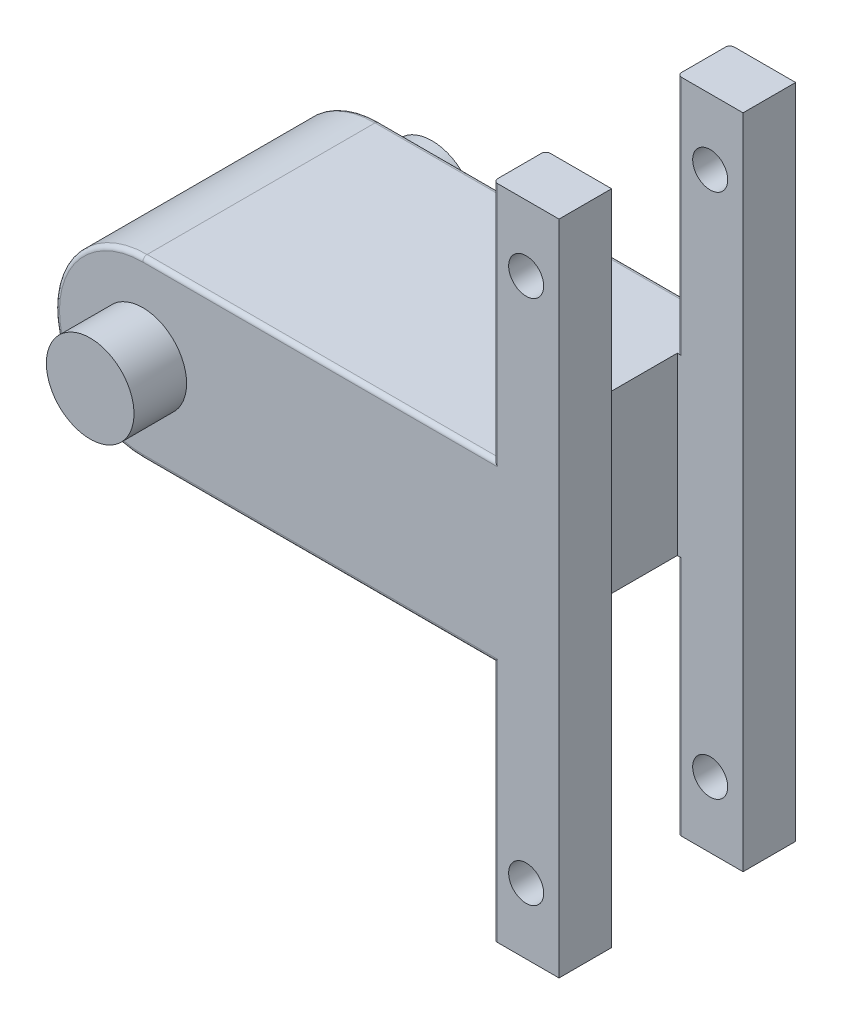
ISO-10303-21;
HEADER;
FILE_DESCRIPTION(('STEP AP214'),'2;1');
FILE_NAME('part.step','',(''),(''),'','','');
FILE_SCHEMA(('AUTOMOTIVE_DESIGN { 1 0 10303 214 1 1 1 1 }'));
ENDSEC;
DATA;
#1=APPLICATION_CONTEXT('core data for automotive mechanical design processes');
#2=APPLICATION_PROTOCOL_DEFINITION('international standard','automotive_design',2000,#1);
#3=PRODUCT_CONTEXT('',#1,'mechanical');
#4=PRODUCT('Part','Part','',(#3));
#5=PRODUCT_RELATED_PRODUCT_CATEGORY('part','',(#4));
#6=PRODUCT_DEFINITION_FORMATION('','',#4);
#7=PRODUCT_DEFINITION_CONTEXT('part definition',#1,'design');
#8=PRODUCT_DEFINITION('design','',#6,#7);
#9=PRODUCT_DEFINITION_SHAPE('','',#8);
#10=(LENGTH_UNIT() NAMED_UNIT(*) SI_UNIT(.MILLI.,.METRE.));
#11=(NAMED_UNIT(*) PLANE_ANGLE_UNIT() SI_UNIT($,.RADIAN.));
#12=(NAMED_UNIT(*) SI_UNIT($,.STERADIAN.) SOLID_ANGLE_UNIT());
#13=UNCERTAINTY_MEASURE_WITH_UNIT(LENGTH_MEASURE(1.E-05),#10,'distance_accuracy_value','');
#14=(GEOMETRIC_REPRESENTATION_CONTEXT(3) GLOBAL_UNCERTAINTY_ASSIGNED_CONTEXT((#13)) GLOBAL_UNIT_ASSIGNED_CONTEXT((#10,
#11,#12)) REPRESENTATION_CONTEXT('',''));
#15=CARTESIAN_POINT('',(0.,0.,0.));
#16=DIRECTION('',(0.,0.,1.));
#17=DIRECTION('',(1.,0.,0.));
#18=AXIS2_PLACEMENT_3D('',#15,#16,#17);
#19=CARTESIAN_POINT('',(0.,-20.,54.));
#20=DIRECTION('',(1.,0.,0.));
#21=DIRECTION('',(0.,1.,0.));
#22=AXIS2_PLACEMENT_3D('',#19,#20,#21);
#23=PLANE('',#22);
#24=DIRECTION('',(0.,0.,-1.));
#25=VECTOR('',#24,1.);
#26=CARTESIAN_POINT('',(0.,-20.,54.));
#27=LINE('',#26,#25);
#28=CARTESIAN_POINT('',(0.,-20.,11.));
#29=VERTEX_POINT('',#28);
#30=CARTESIAN_POINT('',(0.,-20.,1.));
#31=VERTEX_POINT('',#30);
#32=EDGE_CURVE('E269',#29,#31,#27,.T.);
#33=ORIENTED_EDGE('',*,*,#32,.T.);
#34=DIRECTION('',(0.,-1.,0.));
#35=VECTOR('',#34,1.);
#36=CARTESIAN_POINT('',(0.,-20.,1.));
#37=LINE('',#36,#35);
#38=CARTESIAN_POINT('',(0.,-75.,1.));
#39=VERTEX_POINT('',#38);
#40=EDGE_CURVE('E345',#31,#39,#37,.T.);
#41=ORIENTED_EDGE('',*,*,#40,.T.);
#42=DIRECTION('',(0.,0.,-1.));
#43=VECTOR('',#42,1.);
#44=CARTESIAN_POINT('',(0.,-75.,54.));
#45=LINE('',#44,#43);
#46=CARTESIAN_POINT('',(0.,-75.,11.));
#47=VERTEX_POINT('',#46);
#48=EDGE_CURVE('E255',#47,#39,#45,.T.);
#49=ORIENTED_EDGE('',*,*,#48,.F.);
#50=DIRECTION('',(0.,1.,0.));
#51=VECTOR('',#50,1.);
#52=CARTESIAN_POINT('',(0.,-20.,11.));
#53=LINE('',#52,#51);
#54=EDGE_CURVE('E341',#47,#29,#53,.T.);
#55=ORIENTED_EDGE('',*,*,#54,.T.);
#56=EDGE_LOOP('',(#33,#41,#49,#55));
#57=FACE_BOUND('',#56,.T.);
#58=ADVANCED_FACE('F45',(#57),#23,.F.);
#59=CARTESIAN_POINT('',(15.,-75.,54.));
#60=DIRECTION('',(0.,1.,0.));
#61=DIRECTION('',(0.,0.,1.));
#62=AXIS2_PLACEMENT_3D('',#59,#60,#61);
#63=PLANE('',#62);
#64=ORIENTED_EDGE('',*,*,#48,.T.);
#65=CARTESIAN_POINT('',(1.00000000000002,-75.,1.));
#66=DIRECTION('',(0.,1.,0.));
#67=DIRECTION('',(0.,0.,1.));
#68=AXIS2_PLACEMENT_3D('',#65,#66,#67);
#69=CIRCLE('',#68,1.);
#70=CARTESIAN_POINT('',(1.00000000000002,-75.,0.));
#71=VERTEX_POINT('',#70);
#72=EDGE_CURVE('E351',#39,#71,#69,.F.);
#73=ORIENTED_EDGE('',*,*,#72,.T.);
#74=DIRECTION('',(1.,0.,0.));
#75=VECTOR('',#74,1.);
#76=CARTESIAN_POINT('',(15.,-75.,0.));
#77=LINE('',#76,#75);
#78=CARTESIAN_POINT('',(15.,-75.,0.));
#79=VERTEX_POINT('',#78);
#80=EDGE_CURVE('E506',#71,#79,#77,.T.);
#81=ORIENTED_EDGE('',*,*,#80,.T.);
#82=DIRECTION('',(0.,0.,-1.));
#83=VECTOR('',#82,1.);
#84=CARTESIAN_POINT('',(15.,-75.,54.));
#85=LINE('',#84,#83);
#86=CARTESIAN_POINT('',(14.9999999999998,-75.,12.));
#87=VERTEX_POINT('',#86);
#88=EDGE_CURVE('E256',#87,#79,#85,.T.);
#89=ORIENTED_EDGE('',*,*,#88,.F.);
#90=DIRECTION('',(-1.,0.,0.));
#91=VECTOR('',#90,1.);
#92=CARTESIAN_POINT('',(14.9999999999998,-75.,12.));
#93=LINE('',#92,#91);
#94=CARTESIAN_POINT('',(1.00000000000002,-75.,12.));
#95=VERTEX_POINT('',#94);
#96=EDGE_CURVE('E236',#87,#95,#93,.T.);
#97=ORIENTED_EDGE('',*,*,#96,.T.);
#98=CARTESIAN_POINT('',(1.00000000000002,-75.,11.));
#99=DIRECTION('',(0.,1.,0.));
#100=DIRECTION('',(0.,0.,1.));
#101=AXIS2_PLACEMENT_3D('',#98,#99,#100);
#102=CIRCLE('',#101,1.);
#103=EDGE_CURVE('E348',#95,#47,#102,.F.);
#104=ORIENTED_EDGE('',*,*,#103,.T.);
#105=EDGE_LOOP('',(#64,#73,#81,#89,#97,#104));
#106=FACE_BOUND('',#105,.T.);
#107=ADVANCED_FACE('F565',(#106),#63,.F.);
#108=CARTESIAN_POINT('',(15.,75.,54.));
#109=DIRECTION('',(-1.,0.,0.));
#110=DIRECTION('',(0.,-1.,0.));
#111=AXIS2_PLACEMENT_3D('',#108,#109,#110);
#112=PLANE('',#111);
#113=DIRECTION('',(0.,0.,-1.));
#114=VECTOR('',#113,1.);
#115=CARTESIAN_POINT('',(15.,75.,54.));
#116=LINE('',#115,#114);
#117=CARTESIAN_POINT('',(15.0000000000001,75.,12.));
#118=VERTEX_POINT('',#117);
#119=CARTESIAN_POINT('',(15.,75.,0.));
#120=VERTEX_POINT('',#119);
#121=EDGE_CURVE('E481',#118,#120,#116,.T.);
#122=ORIENTED_EDGE('',*,*,#121,.F.);
#123=DIRECTION('',(0.,1.,0.));
#124=VECTOR('',#123,1.);
#125=CARTESIAN_POINT('',(14.9999999999998,-75.,12.));
#126=LINE('',#125,#124);
#127=EDGE_CURVE('E249',#87,#118,#126,.T.);
#128=ORIENTED_EDGE('',*,*,#127,.F.);
#129=ORIENTED_EDGE('',*,*,#88,.T.);
#130=DIRECTION('',(0.,1.,0.));
#131=VECTOR('',#130,1.);
#132=CARTESIAN_POINT('',(15.,75.,0.));
#133=LINE('',#132,#131);
#134=EDGE_CURVE('E502',#79,#120,#133,.T.);
#135=ORIENTED_EDGE('',*,*,#134,.T.);
#136=EDGE_LOOP('',(#122,#128,#129,#135));
#137=FACE_BOUND('',#136,.T.);
#138=ADVANCED_FACE('F598',(#137),#112,.F.);
#139=CARTESIAN_POINT('',(0.,75.,54.));
#140=DIRECTION('',(0.,-1.,0.));
#141=DIRECTION('',(1.,0.,0.));
#142=AXIS2_PLACEMENT_3D('',#139,#140,#141);
#143=PLANE('',#142);
#144=DIRECTION('',(0.,0.,-1.));
#145=VECTOR('',#144,1.);
#146=CARTESIAN_POINT('',(0.,75.,54.));
#147=LINE('',#146,#145);
#148=CARTESIAN_POINT('',(0.,75.,11.));
#149=VERTEX_POINT('',#148);
#150=CARTESIAN_POINT('',(0.,75.,1.));
#151=VERTEX_POINT('',#150);
#152=EDGE_CURVE('E482',#149,#151,#147,.T.);
#153=ORIENTED_EDGE('',*,*,#152,.F.);
#154=CARTESIAN_POINT('',(0.999999999999971,75.,11.));
#155=DIRECTION('',(0.,-1.,0.));
#156=DIRECTION('',(1.,0.,0.));
#157=AXIS2_PLACEMENT_3D('',#154,#155,#156);
#158=CIRCLE('',#157,1.);
#159=CARTESIAN_POINT('',(0.999999999999978,75.,12.));
#160=VERTEX_POINT('',#159);
#161=EDGE_CURVE('E410',#149,#160,#158,.F.);
#162=ORIENTED_EDGE('',*,*,#161,.T.);
#163=DIRECTION('',(-1.,0.,0.));
#164=VECTOR('',#163,1.);
#165=CARTESIAN_POINT('',(15.0000000000001,75.,12.));
#166=LINE('',#165,#164);
#167=EDGE_CURVE('E237',#118,#160,#166,.T.);
#168=ORIENTED_EDGE('',*,*,#167,.F.);
#169=ORIENTED_EDGE('',*,*,#121,.T.);
#170=DIRECTION('',(-1.,0.,0.));
#171=VECTOR('',#170,1.);
#172=CARTESIAN_POINT('',(0.,75.,0.));
#173=LINE('',#172,#171);
#174=CARTESIAN_POINT('',(0.999999999999971,75.,0.));
#175=VERTEX_POINT('',#174);
#176=EDGE_CURVE('E497',#120,#175,#173,.T.);
#177=ORIENTED_EDGE('',*,*,#176,.T.);
#178=CARTESIAN_POINT('',(0.999999999999971,75.,1.));
#179=DIRECTION('',(0.,-1.,0.));
#180=DIRECTION('',(1.,0.,0.));
#181=AXIS2_PLACEMENT_3D('',#178,#179,#180);
#182=CIRCLE('',#181,1.);
#183=EDGE_CURVE('E407',#175,#151,#182,.F.);
#184=ORIENTED_EDGE('',*,*,#183,.T.);
#185=EDGE_LOOP('',(#153,#162,#168,#169,#177,#184));
#186=FACE_BOUND('',#185,.T.);
#187=ADVANCED_FACE('F604',(#186),#143,.F.);
#188=CARTESIAN_POINT('',(0.,75.,54.));
#189=DIRECTION('',(1.,0.,0.));
#190=DIRECTION('',(0.,1.,0.));
#191=AXIS2_PLACEMENT_3D('',#188,#189,#190);
#192=PLANE('',#191);
#193=DIRECTION('',(0.,0.,-1.));
#194=VECTOR('',#193,1.);
#195=CARTESIAN_POINT('',(0.,20.,54.));
#196=LINE('',#195,#194);
#197=CARTESIAN_POINT('',(0.,20.,11.));
#198=VERTEX_POINT('',#197);
#199=CARTESIAN_POINT('',(0.,20.,1.));
#200=VERTEX_POINT('',#199);
#201=EDGE_CURVE('E487',#198,#200,#196,.T.);
#202=ORIENTED_EDGE('',*,*,#201,.F.);
#203=DIRECTION('',(0.,1.,0.));
#204=VECTOR('',#203,1.);
#205=CARTESIAN_POINT('',(0.,75.,11.));
#206=LINE('',#205,#204);
#207=EDGE_CURVE('E403',#198,#149,#206,.T.);
#208=ORIENTED_EDGE('',*,*,#207,.T.);
#209=ORIENTED_EDGE('',*,*,#152,.T.);
#210=DIRECTION('',(0.,-1.,0.));
#211=VECTOR('',#210,1.);
#212=CARTESIAN_POINT('',(0.,75.,1.));
#213=LINE('',#212,#211);
#214=EDGE_CURVE('E400',#151,#200,#213,.T.);
#215=ORIENTED_EDGE('',*,*,#214,.T.);
#216=EDGE_LOOP('',(#202,#208,#209,#215));
#217=FACE_BOUND('',#216,.T.);
#218=ADVANCED_FACE('F610',(#217),#192,.F.);
#219=CARTESIAN_POINT('',(7.49999999999998,60.,54.));
#220=DIRECTION('',(0.,0.,-1.));
#221=DIRECTION('',(-1.,0.,0.));
#222=AXIS2_PLACEMENT_3D('',#219,#220,#221);
#223=CYLINDRICAL_SURFACE('',#222,4.);
#224=CARTESIAN_POINT('',(7.49999999999998,60.,12.));
#225=DIRECTION('',(0.,0.,-1.));
#226=DIRECTION('',(-1.,0.,0.));
#227=AXIS2_PLACEMENT_3D('',#224,#225,#226);
#228=CIRCLE('',#227,4.);
#229=CARTESIAN_POINT('',(3.49999999999998,60.,12.));
#230=VERTEX_POINT('',#229);
#231=EDGE_CURVE('E297',#230,#230,#228,.T.);
#232=ORIENTED_EDGE('',*,*,#231,.F.);
#233=EDGE_LOOP('',(#232));
#234=FACE_BOUND('',#233,.T.);
#235=CARTESIAN_POINT('',(7.49999999999998,60.,0.));
#236=DIRECTION('',(0.,0.,1.));
#237=DIRECTION('',(1.,0.,0.));
#238=AXIS2_PLACEMENT_3D('',#235,#236,#237);
#239=CIRCLE('',#238,4.);
#240=CARTESIAN_POINT('',(11.5,60.,0.));
#241=VERTEX_POINT('',#240);
#242=EDGE_CURVE('E516',#241,#241,#239,.T.);
#243=ORIENTED_EDGE('',*,*,#242,.F.);
#244=EDGE_LOOP('',(#243));
#245=FACE_BOUND('',#244,.T.);
#246=ADVANCED_FACE('F845',(#234,#245),#223,.F.);
#247=CARTESIAN_POINT('',(7.50000000000001,-60.,54.));
#248=DIRECTION('',(0.,0.,-1.));
#249=DIRECTION('',(-1.,0.,0.));
#250=AXIS2_PLACEMENT_3D('',#247,#248,#249);
#251=CYLINDRICAL_SURFACE('',#250,4.);
#252=CARTESIAN_POINT('',(7.50000000000001,-60.,12.));
#253=DIRECTION('',(0.,0.,-1.));
#254=DIRECTION('',(-1.,0.,0.));
#255=AXIS2_PLACEMENT_3D('',#252,#253,#254);
#256=CIRCLE('',#255,4.);
#257=CARTESIAN_POINT('',(3.50000000000001,-60.,12.));
#258=VERTEX_POINT('',#257);
#259=EDGE_CURVE('E293',#258,#258,#256,.T.);
#260=ORIENTED_EDGE('',*,*,#259,.F.);
#261=EDGE_LOOP('',(#260));
#262=FACE_BOUND('',#261,.T.);
#263=CARTESIAN_POINT('',(7.50000000000001,-60.,0.));
#264=DIRECTION('',(0.,0.,1.));
#265=DIRECTION('',(1.,0.,0.));
#266=AXIS2_PLACEMENT_3D('',#263,#264,#265);
#267=CIRCLE('',#266,4.);
#268=CARTESIAN_POINT('',(11.5,-60.,0.));
#269=VERTEX_POINT('',#268);
#270=EDGE_CURVE('E524',#269,#269,#267,.T.);
#271=ORIENTED_EDGE('',*,*,#270,.F.);
#272=EDGE_LOOP('',(#271));
#273=FACE_BOUND('',#272,.T.);
#274=ADVANCED_FACE('F853',(#262,#273),#251,.F.);
#275=CARTESIAN_POINT('',(-80.,0.,54.));
#276=DIRECTION('',(0.,0.,1.));
#277=DIRECTION('',(1.,0.,0.));
#278=AXIS2_PLACEMENT_3D('',#275,#276,#277);
#279=PLANE('',#278);
#280=CARTESIAN_POINT('',(-80.,0.,54.));
#281=DIRECTION('',(0.,0.,1.));
#282=DIRECTION('',(1.,0.,0.));
#283=AXIS2_PLACEMENT_3D('',#280,#281,#282);
#284=CIRCLE('',#283,9.99999999999999);
#285=CARTESIAN_POINT('',(-70.,0.,54.));
#286=VERTEX_POINT('',#285);
#287=EDGE_CURVE('E282',#286,#286,#284,.T.);
#288=ORIENTED_EDGE('',*,*,#287,.F.);
#289=EDGE_LOOP('',(#288));
#290=FACE_BOUND('',#289,.T.);
#291=CARTESIAN_POINT('',(7.49999999999998,60.,54.));
#292=DIRECTION('',(0.,0.,1.));
#293=DIRECTION('',(1.,0.,0.));
#294=AXIS2_PLACEMENT_3D('',#291,#292,#293);
#295=CIRCLE('',#294,4.);
#296=CARTESIAN_POINT('',(11.5,60.,54.));
#297=VERTEX_POINT('',#296);
#298=EDGE_CURVE('E509',#297,#297,#295,.T.);
#299=ORIENTED_EDGE('',*,*,#298,.F.);
#300=EDGE_LOOP('',(#299));
#301=FACE_BOUND('',#300,.T.);
#302=DIRECTION('',(1.,0.,0.));
#303=VECTOR('',#302,1.);
#304=CARTESIAN_POINT('',(0.,-19.,54.));
#305=LINE('',#304,#303);
#306=CARTESIAN_POINT('',(-80.,-19.,54.));
#307=VERTEX_POINT('',#306);
#308=CARTESIAN_POINT('',(1.00000000000001,-19.,54.));
#309=VERTEX_POINT('',#308);
#310=EDGE_CURVE('E334',#307,#309,#305,.T.);
#311=ORIENTED_EDGE('',*,*,#310,.T.);
#312=DIRECTION('',(0.,-1.,0.));
#313=VECTOR('',#312,1.);
#314=CARTESIAN_POINT('',(1.00000000000002,-75.,54.));
#315=LINE('',#314,#313);
#316=CARTESIAN_POINT('',(1.00000000000002,-75.,54.));
#317=VERTEX_POINT('',#316);
#318=EDGE_CURVE('E338',#309,#317,#315,.T.);
#319=ORIENTED_EDGE('',*,*,#318,.T.);
#320=DIRECTION('',(1.,0.,0.));
#321=VECTOR('',#320,1.);
#322=CARTESIAN_POINT('',(15.,-75.,54.));
#323=LINE('',#322,#321);
#324=CARTESIAN_POINT('',(15.,-75.,54.));
#325=VERTEX_POINT('',#324);
#326=EDGE_CURVE('E501',#317,#325,#323,.T.);
#327=ORIENTED_EDGE('',*,*,#326,.T.);
#328=DIRECTION('',(0.,1.,0.));
#329=VECTOR('',#328,1.);
#330=CARTESIAN_POINT('',(15.,75.,54.));
#331=LINE('',#330,#329);
#332=CARTESIAN_POINT('',(15.,75.,54.));
#333=VERTEX_POINT('',#332);
#334=EDGE_CURVE('E253',#325,#333,#331,.T.);
#335=ORIENTED_EDGE('',*,*,#334,.T.);
#336=DIRECTION('',(-1.,0.,0.));
#337=VECTOR('',#336,1.);
#338=CARTESIAN_POINT('',(0.,75.,54.));
#339=LINE('',#338,#337);
#340=CARTESIAN_POINT('',(0.999999999999979,75.,54.));
#341=VERTEX_POINT('',#340);
#342=EDGE_CURVE('E496',#333,#341,#339,.T.);
#343=ORIENTED_EDGE('',*,*,#342,.T.);
#344=DIRECTION('',(0.,-1.,0.));
#345=VECTOR('',#344,1.);
#346=CARTESIAN_POINT('',(0.999999999999995,20.,54.));
#347=LINE('',#346,#345);
#348=CARTESIAN_POINT('',(0.999999999999995,19.,54.));
#349=VERTEX_POINT('',#348);
#350=EDGE_CURVE('E328',#341,#349,#347,.T.);
#351=ORIENTED_EDGE('',*,*,#350,.T.);
#352=DIRECTION('',(-1.,0.,0.));
#353=VECTOR('',#352,1.);
#354=CARTESIAN_POINT('',(-80.,19.,54.));
#355=LINE('',#354,#353);
#356=CARTESIAN_POINT('',(-80.,19.,54.));
#357=VERTEX_POINT('',#356);
#358=EDGE_CURVE('E325',#349,#357,#355,.T.);
#359=ORIENTED_EDGE('',*,*,#358,.T.);
#360=CARTESIAN_POINT('',(-80.,0.,54.));
#361=DIRECTION('',(0.,0.,1.));
#362=DIRECTION('',(1.,0.,0.));
#363=AXIS2_PLACEMENT_3D('',#360,#361,#362);
#364=CIRCLE('',#363,19.);
#365=EDGE_CURVE('E331',#357,#307,#364,.T.);
#366=ORIENTED_EDGE('',*,*,#365,.T.);
#367=EDGE_LOOP('',(#311,#319,#327,#335,#343,#351,#359,#366));
#368=FACE_BOUND('',#367,.T.);
#369=CARTESIAN_POINT('',(7.50000000000001,-60.,54.));
#370=DIRECTION('',(0.,0.,1.));
#371=DIRECTION('',(1.,0.,0.));
#372=AXIS2_PLACEMENT_3D('',#369,#370,#371);
#373=CIRCLE('',#372,4.);
#374=CARTESIAN_POINT('',(11.5,-60.,54.));
#375=VERTEX_POINT('',#374);
#376=EDGE_CURVE('E520',#375,#375,#373,.T.);
#377=ORIENTED_EDGE('',*,*,#376,.F.);
#378=EDGE_LOOP('',(#377));
#379=FACE_BOUND('',#378,.T.);
#380=ADVANCED_FACE('F637',(#290,#301,#368,#379),#279,.T.);
#381=CARTESIAN_POINT('',(-80.,0.,0.));
#382=DIRECTION('',(0.,0.,1.));
#383=DIRECTION('',(1.,0.,0.));
#384=AXIS2_PLACEMENT_3D('',#381,#382,#383);
#385=PLANE('',#384);
#386=ORIENTED_EDGE('',*,*,#80,.F.);
#387=DIRECTION('',(0.,-1.,0.));
#388=VECTOR('',#387,1.);
#389=CARTESIAN_POINT('',(1.,0.,0.));
#390=LINE('',#389,#388);
#391=CARTESIAN_POINT('',(1.,-19.,0.));
#392=VERTEX_POINT('',#391);
#393=EDGE_CURVE('E316',#71,#392,#390,.F.);
#394=ORIENTED_EDGE('',*,*,#393,.T.);
#395=DIRECTION('',(1.,0.,0.));
#396=VECTOR('',#395,1.);
#397=CARTESIAN_POINT('',(-80.,-19.,0.));
#398=LINE('',#397,#396);
#399=CARTESIAN_POINT('',(-80.,-19.,0.));
#400=VERTEX_POINT('',#399);
#401=EDGE_CURVE('E313',#392,#400,#398,.F.);
#402=ORIENTED_EDGE('',*,*,#401,.T.);
#403=CARTESIAN_POINT('',(-80.,0.,0.));
#404=DIRECTION('',(0.,0.,1.));
#405=DIRECTION('',(1.,0.,0.));
#406=AXIS2_PLACEMENT_3D('',#403,#404,#405);
#407=CIRCLE('',#406,19.);
#408=CARTESIAN_POINT('',(-80.,19.,0.));
#409=VERTEX_POINT('',#408);
#410=EDGE_CURVE('E310',#400,#409,#407,.F.);
#411=ORIENTED_EDGE('',*,*,#410,.T.);
#412=DIRECTION('',(-1.,0.,0.));
#413=VECTOR('',#412,1.);
#414=CARTESIAN_POINT('',(-80.,19.,0.));
#415=LINE('',#414,#413);
#416=CARTESIAN_POINT('',(0.999999999999987,19.,0.));
#417=VERTEX_POINT('',#416);
#418=EDGE_CURVE('E304',#409,#417,#415,.F.);
#419=ORIENTED_EDGE('',*,*,#418,.T.);
#420=DIRECTION('',(0.,-1.,0.));
#421=VECTOR('',#420,1.);
#422=CARTESIAN_POINT('',(1.,0.,0.));
#423=LINE('',#422,#421);
#424=EDGE_CURVE('E307',#417,#175,#423,.F.);
#425=ORIENTED_EDGE('',*,*,#424,.T.);
#426=ORIENTED_EDGE('',*,*,#176,.F.);
#427=ORIENTED_EDGE('',*,*,#134,.F.);
#428=EDGE_LOOP('',(#386,#394,#402,#411,#419,#425,#426,#427));
#429=FACE_BOUND('',#428,.T.);
#430=CARTESIAN_POINT('',(-80.,0.,0.));
#431=DIRECTION('',(0.,0.,1.));
#432=DIRECTION('',(1.,0.,0.));
#433=AXIS2_PLACEMENT_3D('',#430,#431,#432);
#434=CIRCLE('',#433,9.99999999999999);
#435=CARTESIAN_POINT('',(-70.,0.,0.));
#436=VERTEX_POINT('',#435);
#437=EDGE_CURVE('E278',#436,#436,#434,.F.);
#438=ORIENTED_EDGE('',*,*,#437,.F.);
#439=EDGE_LOOP('',(#438));
#440=FACE_BOUND('',#439,.T.);
#441=ORIENTED_EDGE('',*,*,#242,.T.);
#442=EDGE_LOOP('',(#441));
#443=FACE_BOUND('',#442,.T.);
#444=ORIENTED_EDGE('',*,*,#270,.T.);
#445=EDGE_LOOP('',(#444));
#446=FACE_BOUND('',#445,.T.);
#447=ADVANCED_FACE('F593',(#429,#440,#443,#446),#385,.F.);
#448=CARTESIAN_POINT('',(-80.,0.,54.));
#449=DIRECTION('',(0.,0.,-1.));
#450=DIRECTION('',(-1.,0.,0.));
#451=AXIS2_PLACEMENT_3D('',#448,#449,#450);
#452=CYLINDRICAL_SURFACE('',#451,20.);
#453=DIRECTION('',(0.,0.,-1.));
#454=VECTOR('',#453,1.);
#455=CARTESIAN_POINT('',(-80.,20.,54.));
#456=LINE('',#455,#454);
#457=CARTESIAN_POINT('',(-80.,20.,53.));
#458=VERTEX_POINT('',#457);
#459=CARTESIAN_POINT('',(-80.,20.,1.));
#460=VERTEX_POINT('',#459);
#461=EDGE_CURVE('E492',#458,#460,#456,.T.);
#462=ORIENTED_EDGE('',*,*,#461,.T.);
#463=CARTESIAN_POINT('',(-80.,0.,1.));
#464=DIRECTION('',(0.,0.,1.));
#465=DIRECTION('',(1.,0.,0.));
#466=AXIS2_PLACEMENT_3D('',#463,#464,#465);
#467=CIRCLE('',#466,20.);
#468=CARTESIAN_POINT('',(-80.,-20.,1.));
#469=VERTEX_POINT('',#468);
#470=EDGE_CURVE('E322',#460,#469,#467,.T.);
#471=ORIENTED_EDGE('',*,*,#470,.T.);
#472=DIRECTION('',(0.,0.,-1.));
#473=VECTOR('',#472,1.);
#474=CARTESIAN_POINT('',(-80.,-20.,54.));
#475=LINE('',#474,#473);
#476=CARTESIAN_POINT('',(-80.,-20.,53.));
#477=VERTEX_POINT('',#476);
#478=EDGE_CURVE('E274',#477,#469,#475,.T.);
#479=ORIENTED_EDGE('',*,*,#478,.F.);
#480=CARTESIAN_POINT('',(-80.,0.,53.));
#481=DIRECTION('',(0.,0.,1.));
#482=DIRECTION('',(1.,0.,0.));
#483=AXIS2_PLACEMENT_3D('',#480,#481,#482);
#484=CIRCLE('',#483,20.);
#485=EDGE_CURVE('E319',#477,#458,#484,.F.);
#486=ORIENTED_EDGE('',*,*,#485,.T.);
#487=EDGE_LOOP('',(#462,#471,#479,#486));
#488=FACE_BOUND('',#487,.T.);
#489=ADVANCED_FACE('F629',(#488),#452,.T.);
#490=CARTESIAN_POINT('',(-80.,-20.,54.));
#491=DIRECTION('',(0.,1.,0.));
#492=DIRECTION('',(-1.,0.,0.));
#493=AXIS2_PLACEMENT_3D('',#490,#491,#492);
#494=PLANE('',#493);
#495=ORIENTED_EDGE('',*,*,#478,.T.);
#496=DIRECTION('',(1.,0.,0.));
#497=VECTOR('',#496,1.);
#498=CARTESIAN_POINT('',(-80.,-20.,1.));
#499=LINE('',#498,#497);
#500=EDGE_CURVE('E300',#469,#31,#499,.T.);
#501=ORIENTED_EDGE('',*,*,#500,.T.);
#502=ORIENTED_EDGE('',*,*,#32,.F.);
#503=CARTESIAN_POINT('',(1.,-20.,11.));
#504=DIRECTION('',(0.,1.,0.));
#505=DIRECTION('',(-1.,0.,0.));
#506=AXIS2_PLACEMENT_3D('',#503,#504,#505);
#507=CIRCLE('',#506,1.);
#508=CARTESIAN_POINT('',(1.,-20.,12.));
#509=VERTEX_POINT('',#508);
#510=EDGE_CURVE('E419',#29,#509,#507,.T.);
#511=ORIENTED_EDGE('',*,*,#510,.T.);
#512=DIRECTION('',(1.,0.,0.));
#513=VECTOR('',#512,1.);
#514=CARTESIAN_POINT('',(14.9999999999998,-20.,12.));
#515=LINE('',#514,#513);
#516=CARTESIAN_POINT('',(-2.05176835411853E-13,-20.,12.));
#517=VERTEX_POINT('',#516);
#518=EDGE_CURVE('E71',#517,#509,#515,.T.);
#519=ORIENTED_EDGE('',*,*,#518,.F.);
#520=DIRECTION('',(0.,0.,1.));
#521=VECTOR('',#520,1.);
#522=CARTESIAN_POINT('',(-2.08166817117217E-13,-20.,54.));
#523=LINE('',#522,#521);
#524=CARTESIAN_POINT('',(-2.05176835411853E-13,-20.,42.));
#525=VERTEX_POINT('',#524);
#526=EDGE_CURVE('E539',#517,#525,#523,.T.);
#527=ORIENTED_EDGE('',*,*,#526,.T.);
#528=DIRECTION('',(-1.,0.,0.));
#529=VECTOR('',#528,1.);
#530=CARTESIAN_POINT('',(14.9999999999998,-20.,42.));
#531=LINE('',#530,#529);
#532=CARTESIAN_POINT('',(0.999999999999999,-20.,42.));
#533=VERTEX_POINT('',#532);
#534=EDGE_CURVE('E371',#533,#525,#531,.T.);
#535=ORIENTED_EDGE('',*,*,#534,.F.);
#536=CARTESIAN_POINT('',(1.,-20.,43.));
#537=DIRECTION('',(0.,1.,0.));
#538=DIRECTION('',(-1.,0.,0.));
#539=AXIS2_PLACEMENT_3D('',#536,#537,#538);
#540=CIRCLE('',#539,1.);
#541=CARTESIAN_POINT('',(0.,-20.,43.));
#542=VERTEX_POINT('',#541);
#543=EDGE_CURVE('E422',#533,#542,#540,.T.);
#544=ORIENTED_EDGE('',*,*,#543,.T.);
#545=CARTESIAN_POINT('',(0.,-20.,53.));
#546=VERTEX_POINT('',#545);
#547=EDGE_CURVE('E270',#546,#542,#27,.T.);
#548=ORIENTED_EDGE('',*,*,#547,.F.);
#549=DIRECTION('',(1.,0.,0.));
#550=VECTOR('',#549,1.);
#551=CARTESIAN_POINT('',(-80.,-20.,53.));
#552=LINE('',#551,#550);
#553=EDGE_CURVE('E286',#546,#477,#552,.F.);
#554=ORIENTED_EDGE('',*,*,#553,.T.);
#555=EDGE_LOOP('',(#495,#501,#502,#511,#519,#527,#535,#544,#548,#554));
#556=FACE_BOUND('',#555,.T.);
#557=ADVANCED_FACE('F576',(#556),#494,.F.);
#558=ORIENTED_EDGE('',*,*,#547,.T.);
#559=DIRECTION('',(0.,1.,0.));
#560=VECTOR('',#559,1.);
#561=CARTESIAN_POINT('',(0.,-20.,43.));
#562=LINE('',#561,#560);
#563=CARTESIAN_POINT('',(0.,-75.,43.));
#564=VERTEX_POINT('',#563);
#565=EDGE_CURVE('E380',#542,#564,#562,.F.);
#566=ORIENTED_EDGE('',*,*,#565,.T.);
#567=CARTESIAN_POINT('',(0.,-75.,53.));
#568=VERTEX_POINT('',#567);
#569=EDGE_CURVE('E261',#568,#564,#45,.T.);
#570=ORIENTED_EDGE('',*,*,#569,.F.);
#571=DIRECTION('',(0.,-1.,0.));
#572=VECTOR('',#571,1.);
#573=CARTESIAN_POINT('',(0.,-20.,53.));
#574=LINE('',#573,#572);
#575=EDGE_CURVE('E377',#568,#546,#574,.F.);
#576=ORIENTED_EDGE('',*,*,#575,.T.);
#577=EDGE_LOOP('',(#558,#566,#570,#576));
#578=FACE_BOUND('',#577,.T.);
#579=ADVANCED_FACE('F648',(#578),#23,.F.);
#580=ORIENTED_EDGE('',*,*,#569,.T.);
#581=CARTESIAN_POINT('',(1.00000000000002,-75.,43.));
#582=DIRECTION('',(0.,1.,0.));
#583=DIRECTION('',(0.,0.,1.));
#584=AXIS2_PLACEMENT_3D('',#581,#582,#583);
#585=CIRCLE('',#584,1.);
#586=CARTESIAN_POINT('',(1.00000000000001,-75.,42.));
#587=VERTEX_POINT('',#586);
#588=EDGE_CURVE('E231',#564,#587,#585,.F.);
#589=ORIENTED_EDGE('',*,*,#588,.T.);
#590=DIRECTION('',(1.,0.,0.));
#591=VECTOR('',#590,1.);
#592=CARTESIAN_POINT('',(14.9999999999998,-75.,42.));
#593=LINE('',#592,#591);
#594=CARTESIAN_POINT('',(14.9999999999998,-75.,42.));
#595=VERTEX_POINT('',#594);
#596=EDGE_CURVE('E222',#587,#595,#593,.T.);
#597=ORIENTED_EDGE('',*,*,#596,.T.);
#598=EDGE_CURVE('E228',#325,#595,#85,.T.);
#599=ORIENTED_EDGE('',*,*,#598,.F.);
#600=ORIENTED_EDGE('',*,*,#326,.F.);
#601=CARTESIAN_POINT('',(1.00000000000002,-75.,53.));
#602=DIRECTION('',(0.,1.,0.));
#603=DIRECTION('',(0.,0.,1.));
#604=AXIS2_PLACEMENT_3D('',#601,#602,#603);
#605=CIRCLE('',#604,1.);
#606=EDGE_CURVE('E383',#317,#568,#605,.F.);
#607=ORIENTED_EDGE('',*,*,#606,.T.);
#608=EDGE_LOOP('',(#580,#589,#597,#599,#600,#607));
#609=FACE_BOUND('',#608,.T.);
#610=ADVANCED_FACE('F225',(#609),#63,.F.);
#611=ORIENTED_EDGE('',*,*,#598,.T.);
#612=DIRECTION('',(0.,1.,0.));
#613=VECTOR('',#612,1.);
#614=CARTESIAN_POINT('',(14.9999999999998,-75.,42.));
#615=LINE('',#614,#613);
#616=CARTESIAN_POINT('',(15.0000000000001,75.,42.));
#617=VERTEX_POINT('',#616);
#618=EDGE_CURVE('E240',#595,#617,#615,.T.);
#619=ORIENTED_EDGE('',*,*,#618,.T.);
#620=EDGE_CURVE('E264',#333,#617,#116,.T.);
#621=ORIENTED_EDGE('',*,*,#620,.F.);
#622=ORIENTED_EDGE('',*,*,#334,.F.);
#623=EDGE_LOOP('',(#611,#619,#621,#622));
#624=FACE_BOUND('',#623,.T.);
#625=ADVANCED_FACE('F252',(#624),#112,.F.);
#626=CARTESIAN_POINT('',(0.,75.,53.));
#627=VERTEX_POINT('',#626);
#628=CARTESIAN_POINT('',(0.,75.,43.));
#629=VERTEX_POINT('',#628);
#630=EDGE_CURVE('E472',#627,#629,#147,.T.);
#631=ORIENTED_EDGE('',*,*,#630,.F.);
#632=CARTESIAN_POINT('',(0.999999999999979,75.,53.));
#633=DIRECTION('',(0.,-1.,0.));
#634=DIRECTION('',(1.,0.,0.));
#635=AXIS2_PLACEMENT_3D('',#632,#633,#634);
#636=CIRCLE('',#635,1.);
#637=EDGE_CURVE('E397',#627,#341,#636,.F.);
#638=ORIENTED_EDGE('',*,*,#637,.T.);
#639=ORIENTED_EDGE('',*,*,#342,.F.);
#640=ORIENTED_EDGE('',*,*,#620,.T.);
#641=DIRECTION('',(1.,0.,0.));
#642=VECTOR('',#641,1.);
#643=CARTESIAN_POINT('',(15.0000000000001,75.,42.));
#644=LINE('',#643,#642);
#645=CARTESIAN_POINT('',(0.99999999999997,75.,42.));
#646=VERTEX_POINT('',#645);
#647=EDGE_CURVE('E244',#646,#617,#644,.T.);
#648=ORIENTED_EDGE('',*,*,#647,.F.);
#649=CARTESIAN_POINT('',(0.999999999999971,75.,43.));
#650=DIRECTION('',(0.,-1.,0.));
#651=DIRECTION('',(1.,0.,0.));
#652=AXIS2_PLACEMENT_3D('',#649,#650,#651);
#653=CIRCLE('',#652,1.);
#654=EDGE_CURVE('E394',#646,#629,#653,.F.);
#655=ORIENTED_EDGE('',*,*,#654,.T.);
#656=EDGE_LOOP('',(#631,#638,#639,#640,#648,#655));
#657=FACE_BOUND('',#656,.T.);
#658=ADVANCED_FACE('F477',(#657),#143,.F.);
#659=CARTESIAN_POINT('',(0.,20.,53.));
#660=VERTEX_POINT('',#659);
#661=CARTESIAN_POINT('',(0.,20.,43.));
#662=VERTEX_POINT('',#661);
#663=EDGE_CURVE('E475',#660,#662,#196,.T.);
#664=ORIENTED_EDGE('',*,*,#663,.F.);
#665=DIRECTION('',(0.,-1.,0.));
#666=VECTOR('',#665,1.);
#667=CARTESIAN_POINT('',(0.,75.,53.));
#668=LINE('',#667,#666);
#669=EDGE_CURVE('E391',#660,#627,#668,.F.);
#670=ORIENTED_EDGE('',*,*,#669,.T.);
#671=ORIENTED_EDGE('',*,*,#630,.T.);
#672=DIRECTION('',(0.,1.,0.));
#673=VECTOR('',#672,1.);
#674=CARTESIAN_POINT('',(0.,75.,43.));
#675=LINE('',#674,#673);
#676=EDGE_CURVE('E388',#629,#662,#675,.F.);
#677=ORIENTED_EDGE('',*,*,#676,.T.);
#678=EDGE_LOOP('',(#664,#670,#671,#677));
#679=FACE_BOUND('',#678,.T.);
#680=ADVANCED_FACE('F471',(#679),#192,.F.);
#681=CARTESIAN_POINT('',(-80.,20.,54.));
#682=DIRECTION('',(0.,-1.,0.));
#683=DIRECTION('',(1.,0.,0.));
#684=AXIS2_PLACEMENT_3D('',#681,#682,#683);
#685=PLANE('',#684);
#686=ORIENTED_EDGE('',*,*,#201,.T.);
#687=DIRECTION('',(-1.,0.,0.));
#688=VECTOR('',#687,1.);
#689=CARTESIAN_POINT('',(-80.,20.,1.));
#690=LINE('',#689,#688);
#691=EDGE_CURVE('E416',#200,#460,#690,.T.);
#692=ORIENTED_EDGE('',*,*,#691,.T.);
#693=ORIENTED_EDGE('',*,*,#461,.F.);
#694=DIRECTION('',(-1.,0.,0.));
#695=VECTOR('',#694,1.);
#696=CARTESIAN_POINT('',(0.,20.,53.));
#697=LINE('',#696,#695);
#698=EDGE_CURVE('E413',#458,#660,#697,.F.);
#699=ORIENTED_EDGE('',*,*,#698,.T.);
#700=ORIENTED_EDGE('',*,*,#663,.T.);
#701=CARTESIAN_POINT('',(0.999999999999987,20.,43.));
#702=DIRECTION('',(0.,-1.,0.));
#703=DIRECTION('',(1.,0.,0.));
#704=AXIS2_PLACEMENT_3D('',#701,#702,#703);
#705=CIRCLE('',#704,1.);
#706=CARTESIAN_POINT('',(0.999999999999986,20.,42.));
#707=VERTEX_POINT('',#706);
#708=EDGE_CURVE('E55',#662,#707,#705,.T.);
#709=ORIENTED_EDGE('',*,*,#708,.T.);
#710=DIRECTION('',(1.,0.,0.));
#711=VECTOR('',#710,1.);
#712=CARTESIAN_POINT('',(14.9999999999998,20.,42.));
#713=LINE('',#712,#711);
#714=CARTESIAN_POINT('',(-1.31161967103509E-13,20.,42.));
#715=VERTEX_POINT('',#714);
#716=EDGE_CURVE('E63',#715,#707,#713,.T.);
#717=ORIENTED_EDGE('',*,*,#716,.F.);
#718=CARTESIAN_POINT('',(0.,20.,12.));
#719=VERTEX_POINT('',#718);
#720=EDGE_CURVE('E491',#715,#719,#196,.T.);
#721=ORIENTED_EDGE('',*,*,#720,.T.);
#722=DIRECTION('',(-1.,0.,0.));
#723=VECTOR('',#722,1.);
#724=CARTESIAN_POINT('',(14.9999999999998,20.,12.));
#725=LINE('',#724,#723);
#726=CARTESIAN_POINT('',(0.999999999999987,20.,12.));
#727=VERTEX_POINT('',#726);
#728=EDGE_CURVE('E354',#727,#719,#725,.T.);
#729=ORIENTED_EDGE('',*,*,#728,.F.);
#730=CARTESIAN_POINT('',(0.999999999999987,20.,11.));
#731=DIRECTION('',(0.,-1.,0.));
#732=DIRECTION('',(1.,0.,0.));
#733=AXIS2_PLACEMENT_3D('',#730,#731,#732);
#734=CIRCLE('',#733,1.);
#735=EDGE_CURVE('E11',#727,#198,#734,.T.);
#736=ORIENTED_EDGE('',*,*,#735,.T.);
#737=EDGE_LOOP('',(#686,#692,#693,#699,#700,#709,#717,#721,#729,#736));
#738=FACE_BOUND('',#737,.T.);
#739=ADVANCED_FACE('F613',(#738),#685,.F.);
#740=CARTESIAN_POINT('',(7.49999999999998,60.,42.));
#741=DIRECTION('',(0.,0.,1.));
#742=DIRECTION('',(1.,0.,0.));
#743=AXIS2_PLACEMENT_3D('',#740,#741,#742);
#744=CIRCLE('',#743,4.);
#745=CARTESIAN_POINT('',(11.5,60.,42.));
#746=VERTEX_POINT('',#745);
#747=EDGE_CURVE('E291',#746,#746,#744,.T.);
#748=ORIENTED_EDGE('',*,*,#747,.F.);
#749=EDGE_LOOP('',(#748));
#750=FACE_BOUND('',#749,.T.);
#751=ORIENTED_EDGE('',*,*,#298,.T.);
#752=EDGE_LOOP('',(#751));
#753=FACE_BOUND('',#752,.T.);
#754=ADVANCED_FACE('F856',(#750,#753),#223,.F.);
#755=CARTESIAN_POINT('',(7.50000000000001,-60.,42.));
#756=DIRECTION('',(0.,0.,1.));
#757=DIRECTION('',(1.,0.,0.));
#758=AXIS2_PLACEMENT_3D('',#755,#756,#757);
#759=CIRCLE('',#758,4.);
#760=CARTESIAN_POINT('',(11.5,-60.,42.));
#761=VERTEX_POINT('',#760);
#762=EDGE_CURVE('E287',#761,#761,#759,.T.);
#763=ORIENTED_EDGE('',*,*,#762,.F.);
#764=EDGE_LOOP('',(#763));
#765=FACE_BOUND('',#764,.T.);
#766=ORIENTED_EDGE('',*,*,#376,.T.);
#767=EDGE_LOOP('',(#766));
#768=FACE_BOUND('',#767,.T.);
#769=ADVANCED_FACE('F865',(#765,#768),#251,.F.);
#770=CARTESIAN_POINT('',(-80.,0.,-12.));
#771=DIRECTION('',(0.,0.,1.));
#772=DIRECTION('',(1.,0.,0.));
#773=AXIS2_PLACEMENT_3D('',#770,#771,#772);
#774=CYLINDRICAL_SURFACE('',#773,9.99999999999999);
#775=CARTESIAN_POINT('',(-80.,0.,-12.));
#776=DIRECTION('',(0.,0.,-1.));
#777=DIRECTION('',(-1.,0.,0.));
#778=AXIS2_PLACEMENT_3D('',#775,#776,#777);
#779=CIRCLE('',#778,9.99999999999999);
#780=CARTESIAN_POINT('',(-90.,0.,-12.));
#781=VERTEX_POINT('',#780);
#782=EDGE_CURVE('E528',#781,#781,#779,.T.);
#783=ORIENTED_EDGE('',*,*,#782,.F.);
#784=EDGE_LOOP('',(#783));
#785=FACE_BOUND('',#784,.T.);
#786=ORIENTED_EDGE('',*,*,#437,.T.);
#787=EDGE_LOOP('',(#786));
#788=FACE_BOUND('',#787,.T.);
#789=ADVANCED_FACE('F892',(#785,#788),#774,.T.);
#790=CARTESIAN_POINT('',(-80.,0.,-12.));
#791=DIRECTION('',(0.,0.,-1.));
#792=DIRECTION('',(-1.,0.,0.));
#793=AXIS2_PLACEMENT_3D('',#790,#791,#792);
#794=PLANE('',#793);
#795=ORIENTED_EDGE('',*,*,#782,.T.);
#796=EDGE_LOOP('',(#795));
#797=FACE_BOUND('',#796,.T.);
#798=ADVANCED_FACE('F882',(#797),#794,.T.);
#799=CARTESIAN_POINT('',(-80.,0.,66.));
#800=DIRECTION('',(0.,0.,-1.));
#801=DIRECTION('',(-1.,0.,0.));
#802=AXIS2_PLACEMENT_3D('',#799,#800,#801);
#803=CYLINDRICAL_SURFACE('',#802,9.99999999999999);
#804=CARTESIAN_POINT('',(-80.,0.,66.));
#805=DIRECTION('',(0.,0.,-1.));
#806=DIRECTION('',(-1.,0.,0.));
#807=AXIS2_PLACEMENT_3D('',#804,#805,#806);
#808=CIRCLE('',#807,9.99999999999999);
#809=CARTESIAN_POINT('',(-90.,0.,66.));
#810=VERTEX_POINT('',#809);
#811=EDGE_CURVE('E535',#810,#810,#808,.T.);
#812=ORIENTED_EDGE('',*,*,#811,.T.);
#813=EDGE_LOOP('',(#812));
#814=FACE_BOUND('',#813,.T.);
#815=ORIENTED_EDGE('',*,*,#287,.T.);
#816=EDGE_LOOP('',(#815));
#817=FACE_BOUND('',#816,.T.);
#818=ADVANCED_FACE('F872',(#814,#817),#803,.T.);
#819=CARTESIAN_POINT('',(-80.,0.,66.));
#820=DIRECTION('',(0.,0.,1.));
#821=DIRECTION('',(-1.,0.,0.));
#822=AXIS2_PLACEMENT_3D('',#819,#820,#821);
#823=PLANE('',#822);
#824=ORIENTED_EDGE('',*,*,#811,.F.);
#825=EDGE_LOOP('',(#824));
#826=FACE_BOUND('',#825,.T.);
#827=ADVANCED_FACE('F811',(#826),#823,.T.);
#828=CARTESIAN_POINT('',(-3.06947279335825E-13,-75.,12.));
#829=DIRECTION('',(-1.,0.,0.));
#830=DIRECTION('',(0.,-1.,0.));
#831=AXIS2_PLACEMENT_3D('',#828,#829,#830);
#832=PLANE('',#831);
#833=DIRECTION('',(0.,1.,0.));
#834=VECTOR('',#833,1.);
#835=CARTESIAN_POINT('',(-3.06947279335825E-13,-75.,12.));
#836=LINE('',#835,#834);
#837=EDGE_CURVE('E292',#517,#719,#836,.T.);
#838=ORIENTED_EDGE('',*,*,#837,.T.);
#839=ORIENTED_EDGE('',*,*,#720,.F.);
#840=DIRECTION('',(0.,1.,0.));
#841=VECTOR('',#840,1.);
#842=CARTESIAN_POINT('',(-3.06947279335825E-13,-75.,42.));
#843=LINE('',#842,#841);
#844=EDGE_CURVE('E250',#525,#715,#843,.T.);
#845=ORIENTED_EDGE('',*,*,#844,.F.);
#846=ORIENTED_EDGE('',*,*,#526,.F.);
#847=EDGE_LOOP('',(#838,#839,#845,#846));
#848=FACE_BOUND('',#847,.T.);
#849=ADVANCED_FACE('F801',(#848),#832,.F.);
#850=CARTESIAN_POINT('',(14.9999999999998,-75.,12.));
#851=DIRECTION('',(0.,0.,-1.));
#852=DIRECTION('',(-1.,0.,0.));
#853=AXIS2_PLACEMENT_3D('',#850,#851,#852);
#854=PLANE('',#853);
#855=ORIENTED_EDGE('',*,*,#231,.T.);
#856=EDGE_LOOP('',(#855));
#857=FACE_BOUND('',#856,.T.);
#858=ORIENTED_EDGE('',*,*,#259,.T.);
#859=EDGE_LOOP('',(#858));
#860=FACE_BOUND('',#859,.T.);
#861=ORIENTED_EDGE('',*,*,#837,.F.);
#862=ORIENTED_EDGE('',*,*,#518,.T.);
#863=DIRECTION('',(0.,1.,0.));
#864=VECTOR('',#863,1.);
#865=CARTESIAN_POINT('',(1.00000000000002,-75.,12.));
#866=LINE('',#865,#864);
#867=EDGE_CURVE('E361',#509,#95,#866,.F.);
#868=ORIENTED_EDGE('',*,*,#867,.T.);
#869=ORIENTED_EDGE('',*,*,#96,.F.);
#870=ORIENTED_EDGE('',*,*,#127,.T.);
#871=ORIENTED_EDGE('',*,*,#167,.T.);
#872=DIRECTION('',(0.,1.,0.));
#873=VECTOR('',#872,1.);
#874=CARTESIAN_POINT('',(1.00000000000001,-75.,12.));
#875=LINE('',#874,#873);
#876=EDGE_CURVE('E357',#160,#727,#875,.F.);
#877=ORIENTED_EDGE('',*,*,#876,.T.);
#878=ORIENTED_EDGE('',*,*,#728,.T.);
#879=EDGE_LOOP('',(#861,#862,#868,#869,#870,#871,#877,#878));
#880=FACE_BOUND('',#879,.T.);
#881=ADVANCED_FACE('F600',(#857,#860,#880),#854,.F.);
#882=CARTESIAN_POINT('',(14.9999999999998,-75.,42.));
#883=DIRECTION('',(0.,0.,1.));
#884=DIRECTION('',(1.,0.,0.));
#885=AXIS2_PLACEMENT_3D('',#882,#883,#884);
#886=PLANE('',#885);
#887=ORIENTED_EDGE('',*,*,#747,.T.);
#888=EDGE_LOOP('',(#887));
#889=FACE_BOUND('',#888,.T.);
#890=ORIENTED_EDGE('',*,*,#762,.T.);
#891=EDGE_LOOP('',(#890));
#892=FACE_BOUND('',#891,.T.);
#893=ORIENTED_EDGE('',*,*,#596,.F.);
#894=DIRECTION('',(0.,1.,0.));
#895=VECTOR('',#894,1.);
#896=CARTESIAN_POINT('',(1.00000000000002,-75.,42.));
#897=LINE('',#896,#895);
#898=EDGE_CURVE('E374',#587,#533,#897,.T.);
#899=ORIENTED_EDGE('',*,*,#898,.T.);
#900=ORIENTED_EDGE('',*,*,#534,.T.);
#901=ORIENTED_EDGE('',*,*,#844,.T.);
#902=ORIENTED_EDGE('',*,*,#716,.T.);
#903=DIRECTION('',(0.,1.,0.));
#904=VECTOR('',#903,1.);
#905=CARTESIAN_POINT('',(1.00000000000001,-75.,42.));
#906=LINE('',#905,#904);
#907=EDGE_CURVE('E368',#707,#646,#906,.T.);
#908=ORIENTED_EDGE('',*,*,#907,.T.);
#909=ORIENTED_EDGE('',*,*,#647,.T.);
#910=ORIENTED_EDGE('',*,*,#618,.F.);
#911=EDGE_LOOP('',(#893,#899,#900,#901,#902,#908,#909,#910));
#912=FACE_BOUND('',#911,.T.);
#913=ADVANCED_FACE('F241',(#889,#892,#912),#886,.F.);
#914=CARTESIAN_POINT('',(0.999999999999971,75.,1.));
#915=DIRECTION('',(0.,-1.,0.));
#916=DIRECTION('',(1.,0.,0.));
#917=AXIS2_PLACEMENT_3D('',#914,#915,#916);
#918=CYLINDRICAL_SURFACE('',#917,1.);
#919=ORIENTED_EDGE('',*,*,#183,.F.);
#920=ORIENTED_EDGE('',*,*,#424,.F.);
#921=CARTESIAN_POINT('',(0.999999999999987,19.,1.));
#922=DIRECTION('',(-0.707106781186547,-0.707106781186548,0.));
#923=DIRECTION('',(0.707106781186548,-0.707106781186547,0.));
#924=AXIS2_PLACEMENT_3D('',#921,#922,#923);
#925=ELLIPSE('',#924,1.4142135623731,1.);
#926=EDGE_CURVE('E438',#200,#417,#925,.T.);
#927=ORIENTED_EDGE('',*,*,#926,.F.);
#928=ORIENTED_EDGE('',*,*,#214,.F.);
#929=EDGE_LOOP('',(#919,#920,#927,#928));
#930=FACE_BOUND('',#929,.T.);
#931=ADVANCED_FACE('F619',(#930),#918,.T.);
#932=CARTESIAN_POINT('',(-80.,19.,1.));
#933=DIRECTION('',(-1.,0.,0.));
#934=DIRECTION('',(0.,-1.,0.));
#935=AXIS2_PLACEMENT_3D('',#932,#933,#934);
#936=CYLINDRICAL_SURFACE('',#935,1.);
#937=ORIENTED_EDGE('',*,*,#926,.T.);
#938=ORIENTED_EDGE('',*,*,#418,.F.);
#939=CARTESIAN_POINT('',(-80.,19.,1.));
#940=DIRECTION('',(-1.,0.,0.));
#941=DIRECTION('',(0.,0.,1.));
#942=AXIS2_PLACEMENT_3D('',#939,#940,#941);
#943=CIRCLE('',#942,1.);
#944=EDGE_CURVE('E434',#460,#409,#943,.T.);
#945=ORIENTED_EDGE('',*,*,#944,.F.);
#946=ORIENTED_EDGE('',*,*,#691,.F.);
#947=EDGE_LOOP('',(#937,#938,#945,#946));
#948=FACE_BOUND('',#947,.T.);
#949=ADVANCED_FACE('F623',(#948),#936,.T.);
#950=CARTESIAN_POINT('',(-80.,0.,1.));
#951=DIRECTION('',(0.,0.,1.));
#952=DIRECTION('',(1.,0.,0.));
#953=AXIS2_PLACEMENT_3D('',#950,#951,#952);
#954=TOROIDAL_SURFACE('',#953,19.,1.);
#955=ORIENTED_EDGE('',*,*,#944,.T.);
#956=ORIENTED_EDGE('',*,*,#410,.F.);
#957=CARTESIAN_POINT('',(-80.,-19.,1.));
#958=DIRECTION('',(1.,0.,0.));
#959=DIRECTION('',(0.,0.,-1.));
#960=AXIS2_PLACEMENT_3D('',#957,#958,#959);
#961=CIRCLE('',#960,1.);
#962=EDGE_CURVE('E430',#469,#400,#961,.T.);
#963=ORIENTED_EDGE('',*,*,#962,.F.);
#964=ORIENTED_EDGE('',*,*,#470,.F.);
#965=EDGE_LOOP('',(#955,#956,#963,#964));
#966=FACE_BOUND('',#965,.T.);
#967=ADVANCED_FACE('F627',(#966),#954,.T.);
#968=CARTESIAN_POINT('',(1.,-20.,1.));
#969=DIRECTION('',(0.,-1.,0.));
#970=DIRECTION('',(1.,0.,0.));
#971=AXIS2_PLACEMENT_3D('',#968,#969,#970);
#972=CYLINDRICAL_SURFACE('',#971,1.);
#973=ORIENTED_EDGE('',*,*,#72,.F.);
#974=ORIENTED_EDGE('',*,*,#40,.F.);
#975=CARTESIAN_POINT('',(1.,-19.,1.));
#976=DIRECTION('',(0.707106781186548,-0.707106781186547,0.));
#977=DIRECTION('',(0.707106781186547,0.707106781186548,0.));
#978=AXIS2_PLACEMENT_3D('',#975,#976,#977);
#979=ELLIPSE('',#978,1.41421356237309,1.);
#980=EDGE_CURVE('E427',#392,#31,#979,.F.);
#981=ORIENTED_EDGE('',*,*,#980,.F.);
#982=ORIENTED_EDGE('',*,*,#393,.F.);
#983=EDGE_LOOP('',(#973,#974,#981,#982));
#984=FACE_BOUND('',#983,.T.);
#985=ADVANCED_FACE('F589',(#984),#972,.T.);
#986=CARTESIAN_POINT('',(-80.,-19.,1.));
#987=DIRECTION('',(1.,0.,0.));
#988=DIRECTION('',(0.,1.,0.));
#989=AXIS2_PLACEMENT_3D('',#986,#987,#988);
#990=CYLINDRICAL_SURFACE('',#989,1.);
#991=ORIENTED_EDGE('',*,*,#962,.T.);
#992=ORIENTED_EDGE('',*,*,#401,.F.);
#993=ORIENTED_EDGE('',*,*,#980,.T.);
#994=ORIENTED_EDGE('',*,*,#500,.F.);
#995=EDGE_LOOP('',(#991,#992,#993,#994));
#996=FACE_BOUND('',#995,.T.);
#997=ADVANCED_FACE('F582',(#996),#990,.T.);
#998=CARTESIAN_POINT('',(1.,0.,53.));
#999=DIRECTION('',(0.,1.,0.));
#1000=DIRECTION('',(-1.,0.,0.));
#1001=AXIS2_PLACEMENT_3D('',#998,#999,#1000);
#1002=CYLINDRICAL_SURFACE('',#1001,1.);
#1003=ORIENTED_EDGE('',*,*,#637,.F.);
#1004=ORIENTED_EDGE('',*,*,#669,.F.);
#1005=CARTESIAN_POINT('',(0.999999999999998,19.,53.));
#1006=DIRECTION('',(0.707106781186547,0.707106781186548,0.));
#1007=DIRECTION('',(-0.707106781186548,0.707106781186547,0.));
#1008=AXIS2_PLACEMENT_3D('',#1005,#1006,#1007);
#1009=ELLIPSE('',#1008,1.4142135623731,1.);
#1010=EDGE_CURVE('E49',#349,#660,#1009,.F.);
#1011=ORIENTED_EDGE('',*,*,#1010,.F.);
#1012=ORIENTED_EDGE('',*,*,#350,.F.);
#1013=EDGE_LOOP('',(#1003,#1004,#1011,#1012));
#1014=FACE_BOUND('',#1013,.T.);
#1015=ADVANCED_FACE('F466',(#1014),#1002,.T.);
#1016=CARTESIAN_POINT('',(-80.,19.,53.));
#1017=DIRECTION('',(1.,0.,0.));
#1018=DIRECTION('',(0.,1.,0.));
#1019=AXIS2_PLACEMENT_3D('',#1016,#1017,#1018);
#1020=CYLINDRICAL_SURFACE('',#1019,1.);
#1021=ORIENTED_EDGE('',*,*,#1010,.T.);
#1022=ORIENTED_EDGE('',*,*,#698,.F.);
#1023=CARTESIAN_POINT('',(-80.,19.,53.));
#1024=DIRECTION('',(-1.,0.,0.));
#1025=DIRECTION('',(0.,0.,1.));
#1026=AXIS2_PLACEMENT_3D('',#1023,#1024,#1025);
#1027=CIRCLE('',#1026,1.);
#1028=EDGE_CURVE('E448',#357,#458,#1027,.T.);
#1029=ORIENTED_EDGE('',*,*,#1028,.F.);
#1030=ORIENTED_EDGE('',*,*,#358,.F.);
#1031=EDGE_LOOP('',(#1021,#1022,#1029,#1030));
#1032=FACE_BOUND('',#1031,.T.);
#1033=ADVANCED_FACE('F461',(#1032),#1020,.T.);
#1034=CARTESIAN_POINT('',(-80.,0.,53.));
#1035=DIRECTION('',(0.,0.,1.));
#1036=DIRECTION('',(1.,0.,0.));
#1037=AXIS2_PLACEMENT_3D('',#1034,#1035,#1036);
#1038=TOROIDAL_SURFACE('',#1037,19.,1.);
#1039=ORIENTED_EDGE('',*,*,#1028,.T.);
#1040=ORIENTED_EDGE('',*,*,#485,.F.);
#1041=CARTESIAN_POINT('',(-80.,-19.,53.));
#1042=DIRECTION('',(1.,0.,0.));
#1043=DIRECTION('',(0.,0.,-1.));
#1044=AXIS2_PLACEMENT_3D('',#1041,#1042,#1043);
#1045=CIRCLE('',#1044,1.);
#1046=EDGE_CURVE('E445',#307,#477,#1045,.T.);
#1047=ORIENTED_EDGE('',*,*,#1046,.F.);
#1048=ORIENTED_EDGE('',*,*,#365,.F.);
#1049=EDGE_LOOP('',(#1039,#1040,#1047,#1048));
#1050=FACE_BOUND('',#1049,.T.);
#1051=ADVANCED_FACE('F656',(#1050),#1038,.T.);
#1052=CARTESIAN_POINT('',(1.,0.,53.));
#1053=DIRECTION('',(0.,1.,0.));
#1054=DIRECTION('',(-1.,0.,0.));
#1055=AXIS2_PLACEMENT_3D('',#1052,#1053,#1054);
#1056=CYLINDRICAL_SURFACE('',#1055,1.);
#1057=ORIENTED_EDGE('',*,*,#606,.F.);
#1058=ORIENTED_EDGE('',*,*,#318,.F.);
#1059=CARTESIAN_POINT('',(1.,-19.,53.));
#1060=DIRECTION('',(-0.707106781186548,0.707106781186547,0.));
#1061=DIRECTION('',(-0.707106781186547,-0.707106781186548,0.));
#1062=AXIS2_PLACEMENT_3D('',#1059,#1060,#1061);
#1063=ELLIPSE('',#1062,1.41421356237309,1.);
#1064=EDGE_CURVE('E442',#546,#309,#1063,.T.);
#1065=ORIENTED_EDGE('',*,*,#1064,.F.);
#1066=ORIENTED_EDGE('',*,*,#575,.F.);
#1067=EDGE_LOOP('',(#1057,#1058,#1065,#1066));
#1068=FACE_BOUND('',#1067,.T.);
#1069=ADVANCED_FACE('F644',(#1068),#1056,.T.);
#1070=CARTESIAN_POINT('',(-80.,-19.,53.));
#1071=DIRECTION('',(-1.,0.,0.));
#1072=DIRECTION('',(0.,-1.,0.));
#1073=AXIS2_PLACEMENT_3D('',#1070,#1071,#1072);
#1074=CYLINDRICAL_SURFACE('',#1073,1.);
#1075=ORIENTED_EDGE('',*,*,#1046,.T.);
#1076=ORIENTED_EDGE('',*,*,#553,.F.);
#1077=ORIENTED_EDGE('',*,*,#1064,.T.);
#1078=ORIENTED_EDGE('',*,*,#310,.F.);
#1079=EDGE_LOOP('',(#1075,#1076,#1077,#1078));
#1080=FACE_BOUND('',#1079,.T.);
#1081=ADVANCED_FACE('F653',(#1080),#1074,.T.);
#1082=CARTESIAN_POINT('',(1.,-20.,11.));
#1083=DIRECTION('',(0.,1.,0.));
#1084=DIRECTION('',(-1.,0.,0.));
#1085=AXIS2_PLACEMENT_3D('',#1082,#1083,#1084);
#1086=CYLINDRICAL_SURFACE('',#1085,1.);
#1087=ORIENTED_EDGE('',*,*,#103,.F.);
#1088=ORIENTED_EDGE('',*,*,#867,.F.);
#1089=ORIENTED_EDGE('',*,*,#510,.F.);
#1090=ORIENTED_EDGE('',*,*,#54,.F.);
#1091=EDGE_LOOP('',(#1087,#1088,#1089,#1090));
#1092=FACE_BOUND('',#1091,.T.);
#1093=ADVANCED_FACE('F572',(#1092),#1086,.T.);
#1094=CARTESIAN_POINT('',(1.00000000000002,-75.,43.));
#1095=DIRECTION('',(0.,1.,0.));
#1096=DIRECTION('',(-1.,0.,0.));
#1097=AXIS2_PLACEMENT_3D('',#1094,#1095,#1096);
#1098=CYLINDRICAL_SURFACE('',#1097,1.);
#1099=ORIENTED_EDGE('',*,*,#588,.F.);
#1100=ORIENTED_EDGE('',*,*,#565,.F.);
#1101=ORIENTED_EDGE('',*,*,#543,.F.);
#1102=ORIENTED_EDGE('',*,*,#898,.F.);
#1103=EDGE_LOOP('',(#1099,#1100,#1101,#1102));
#1104=FACE_BOUND('',#1103,.T.);
#1105=ADVANCED_FACE('F697',(#1104),#1098,.T.);
#1106=CARTESIAN_POINT('',(1.00000000000001,-75.,43.));
#1107=DIRECTION('',(0.,1.,0.));
#1108=DIRECTION('',(-1.,0.,0.));
#1109=AXIS2_PLACEMENT_3D('',#1106,#1107,#1108);
#1110=CYLINDRICAL_SURFACE('',#1109,1.);
#1111=ORIENTED_EDGE('',*,*,#708,.F.);
#1112=ORIENTED_EDGE('',*,*,#676,.F.);
#1113=ORIENTED_EDGE('',*,*,#654,.F.);
#1114=ORIENTED_EDGE('',*,*,#907,.F.);
#1115=EDGE_LOOP('',(#1111,#1112,#1113,#1114));
#1116=FACE_BOUND('',#1115,.T.);
#1117=ADVANCED_FACE('F634',(#1116),#1110,.T.);
#1118=CARTESIAN_POINT('',(0.999999999999971,75.,11.));
#1119=DIRECTION('',(0.,1.,0.));
#1120=DIRECTION('',(-1.,0.,0.));
#1121=AXIS2_PLACEMENT_3D('',#1118,#1119,#1120);
#1122=CYLINDRICAL_SURFACE('',#1121,1.);
#1123=ORIENTED_EDGE('',*,*,#735,.F.);
#1124=ORIENTED_EDGE('',*,*,#876,.F.);
#1125=ORIENTED_EDGE('',*,*,#161,.F.);
#1126=ORIENTED_EDGE('',*,*,#207,.F.);
#1127=EDGE_LOOP('',(#1123,#1124,#1125,#1126));
#1128=FACE_BOUND('',#1127,.T.);
#1129=ADVANCED_FACE('F47',(#1128),#1122,.T.);
#1130=CLOSED_SHELL('',(#58,#107,#138,#187,#218,#246,#274,#380,#447,#489,#557,#579,#610,#625,
#658,#680,#739,#754,#769,#789,#798,#818,#827,#849,#881,#913,#931,#949,#967,#985,#997,#1015,
#1033,#1051,#1069,#1081,#1093,#1105,#1117,#1129));
#1131=MANIFOLD_SOLID_BREP('B2',#1130);
#1132=ADVANCED_BREP_SHAPE_REPRESENTATION('',(#18,#1131),#14);
#1133=SHAPE_DEFINITION_REPRESENTATION(#9,#1132);
ENDSEC;
END-ISO-10303-21;
